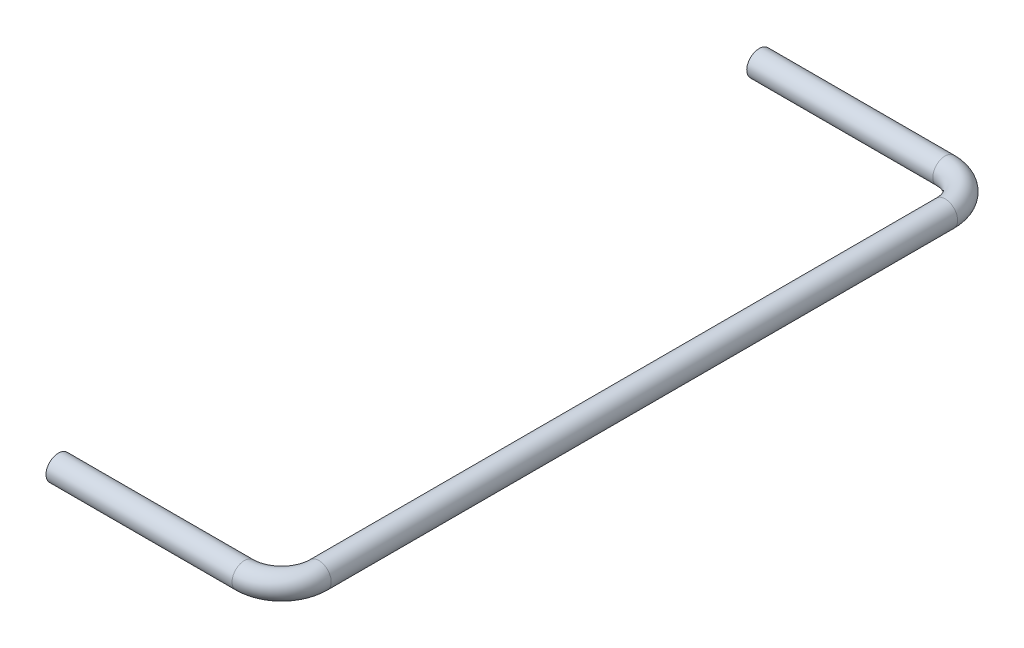
ISO-10303-21;
HEADER;
FILE_DESCRIPTION(('STEP AP214'),'2;1');
FILE_NAME('part.step','',(''),(''),'','','');
FILE_SCHEMA(('AUTOMOTIVE_DESIGN { 1 0 10303 214 1 1 1 1 }'));
ENDSEC;
DATA;
#1=APPLICATION_CONTEXT('core data for automotive mechanical design processes');
#2=APPLICATION_PROTOCOL_DEFINITION('international standard','automotive_design',2000,#1);
#3=PRODUCT_CONTEXT('',#1,'mechanical');
#4=PRODUCT('Part','Part','',(#3));
#5=PRODUCT_RELATED_PRODUCT_CATEGORY('part','',(#4));
#6=PRODUCT_DEFINITION_FORMATION('','',#4);
#7=PRODUCT_DEFINITION_CONTEXT('part definition',#1,'design');
#8=PRODUCT_DEFINITION('design','',#6,#7);
#9=PRODUCT_DEFINITION_SHAPE('','',#8);
#10=(LENGTH_UNIT() NAMED_UNIT(*) SI_UNIT(.MILLI.,.METRE.));
#11=(NAMED_UNIT(*) PLANE_ANGLE_UNIT() SI_UNIT($,.RADIAN.));
#12=(NAMED_UNIT(*) SI_UNIT($,.STERADIAN.) SOLID_ANGLE_UNIT());
#13=UNCERTAINTY_MEASURE_WITH_UNIT(LENGTH_MEASURE(1.E-05),#10,'distance_accuracy_value','');
#14=(GEOMETRIC_REPRESENTATION_CONTEXT(3) GLOBAL_UNCERTAINTY_ASSIGNED_CONTEXT((#13)) GLOBAL_UNIT_ASSIGNED_CONTEXT((#10,
#11,#12)) REPRESENTATION_CONTEXT('',''));
#15=CARTESIAN_POINT('',(0.,0.,0.));
#16=DIRECTION('',(0.,0.,1.));
#17=DIRECTION('',(1.,0.,0.));
#18=AXIS2_PLACEMENT_3D('',#15,#16,#17);
#19=CARTESIAN_POINT('',(15.,0.,-56.5));
#20=DIRECTION('',(-1.,0.,0.));
#21=DIRECTION('',(0.,0.,1.));
#22=AXIS2_PLACEMENT_3D('',#19,#20,#21);
#23=CYLINDRICAL_SURFACE('',#22,1.);
#24=CARTESIAN_POINT('',(15.,0.,-56.5));
#25=DIRECTION('',(-1.,0.,0.));
#26=DIRECTION('',(0.,0.,1.));
#27=AXIS2_PLACEMENT_3D('',#24,#25,#26);
#28=CIRCLE('',#27,1.);
#29=CARTESIAN_POINT('',(15.,0.,-57.5));
#30=VERTEX_POINT('',#29);
#31=EDGE_CURVE('E36',#30,#30,#28,.T.);
#32=ORIENTED_EDGE('',*,*,#31,.T.);
#33=EDGE_LOOP('',(#32));
#34=FACE_BOUND('',#33,.T.);
#35=CARTESIAN_POINT('',(0.,0.,-56.5));
#36=DIRECTION('',(-1.,0.,0.));
#37=DIRECTION('',(0.,0.,1.));
#38=AXIS2_PLACEMENT_3D('',#35,#36,#37);
#39=CIRCLE('',#38,1.);
#40=CARTESIAN_POINT('',(0.,0.,-55.5));
#41=VERTEX_POINT('',#40);
#42=EDGE_CURVE('E10',#41,#41,#39,.T.);
#43=ORIENTED_EDGE('',*,*,#42,.F.);
#44=EDGE_LOOP('',(#43));
#45=FACE_BOUND('',#44,.T.);
#46=ADVANCED_FACE('F30',(#34,#45),#23,.T.);
#47=CARTESIAN_POINT('',(15.,0.,-53.5));
#48=DIRECTION('',(0.,1.,0.));
#49=DIRECTION('',(0.,0.,1.));
#50=AXIS2_PLACEMENT_3D('',#47,#48,#49);
#51=TOROIDAL_SURFACE('',#50,3.,1.);
#52=CARTESIAN_POINT('',(18.,0.,-53.5));
#53=DIRECTION('',(0.,0.,-1.));
#54=DIRECTION('',(-1.,0.,0.));
#55=AXIS2_PLACEMENT_3D('',#52,#53,#54);
#56=CIRCLE('',#55,1.);
#57=CARTESIAN_POINT('',(19.,0.,-53.5));
#58=VERTEX_POINT('',#57);
#59=EDGE_CURVE('E40',#58,#58,#56,.T.);
#60=CARTESIAN_POINT('',(15.,0.,-53.5));
#61=DIRECTION('',(0.,1.,0.));
#62=DIRECTION('',(0.,0.,1.));
#63=AXIS2_PLACEMENT_3D('',#60,#61,#62);
#64=CIRCLE('',#63,4.);
#65=EDGE_CURVE('',#58,#30,#64,.T.);
#66=ORIENTED_EDGE('',*,*,#59,.T.);
#67=ORIENTED_EDGE('',*,*,#31,.F.);
#68=ORIENTED_EDGE('',*,*,#65,.T.);
#69=ORIENTED_EDGE('',*,*,#65,.F.);
#70=EDGE_LOOP('',(#66,#68,#67,#69));
#71=FACE_BOUND('',#70,.T.);
#72=ADVANCED_FACE('F74',(#71),#51,.T.);
#73=CARTESIAN_POINT('',(18.,0.,-3.));
#74=DIRECTION('',(0.,0.,-1.));
#75=DIRECTION('',(-1.,0.,0.));
#76=AXIS2_PLACEMENT_3D('',#73,#74,#75);
#77=CYLINDRICAL_SURFACE('',#76,1.);
#78=CARTESIAN_POINT('',(18.,0.,-3.));
#79=DIRECTION('',(0.,0.,-1.));
#80=DIRECTION('',(-1.,0.,0.));
#81=AXIS2_PLACEMENT_3D('',#78,#79,#80);
#82=CIRCLE('',#81,1.);
#83=CARTESIAN_POINT('',(19.,0.,-3.));
#84=VERTEX_POINT('',#83);
#85=EDGE_CURVE('E44',#84,#84,#82,.T.);
#86=ORIENTED_EDGE('',*,*,#85,.T.);
#87=EDGE_LOOP('',(#86));
#88=FACE_BOUND('',#87,.T.);
#89=ORIENTED_EDGE('',*,*,#59,.F.);
#90=EDGE_LOOP('',(#89));
#91=FACE_BOUND('',#90,.T.);
#92=ADVANCED_FACE('F78',(#88,#91),#77,.T.);
#93=CARTESIAN_POINT('',(15.,0.,-3.));
#94=DIRECTION('',(0.,1.,0.));
#95=DIRECTION('',(0.,0.,1.));
#96=AXIS2_PLACEMENT_3D('',#93,#94,#95);
#97=TOROIDAL_SURFACE('',#96,3.,1.);
#98=CARTESIAN_POINT('',(15.,0.,0.));
#99=DIRECTION('',(1.,0.,0.));
#100=DIRECTION('',(0.,0.,-1.));
#101=AXIS2_PLACEMENT_3D('',#98,#99,#100);
#102=CIRCLE('',#101,1.);
#103=CARTESIAN_POINT('',(15.,0.,1.));
#104=VERTEX_POINT('',#103);
#105=EDGE_CURVE('E49',#104,#104,#102,.T.);
#106=CARTESIAN_POINT('',(15.,0.,-3.));
#107=DIRECTION('',(0.,1.,0.));
#108=DIRECTION('',(0.,0.,1.));
#109=AXIS2_PLACEMENT_3D('',#106,#107,#108);
#110=CIRCLE('',#109,4.);
#111=EDGE_CURVE('',#104,#84,#110,.T.);
#112=ORIENTED_EDGE('',*,*,#105,.T.);
#113=ORIENTED_EDGE('',*,*,#85,.F.);
#114=ORIENTED_EDGE('',*,*,#111,.T.);
#115=ORIENTED_EDGE('',*,*,#111,.F.);
#116=EDGE_LOOP('',(#112,#114,#113,#115));
#117=FACE_BOUND('',#116,.T.);
#118=ADVANCED_FACE('F56',(#117),#97,.T.);
#119=CARTESIAN_POINT('',(15.,0.,0.));
#120=DIRECTION('',(-1.,0.,0.));
#121=DIRECTION('',(0.,0.,1.));
#122=AXIS2_PLACEMENT_3D('',#119,#120,#121);
#123=CYLINDRICAL_SURFACE('',#122,1.);
#124=ORIENTED_EDGE('',*,*,#105,.F.);
#125=EDGE_LOOP('',(#124));
#126=FACE_BOUND('',#125,.T.);
#127=CARTESIAN_POINT('',(0.,0.,0.));
#128=DIRECTION('',(1.,0.,0.));
#129=DIRECTION('',(0.,0.,-1.));
#130=AXIS2_PLACEMENT_3D('',#127,#128,#129);
#131=CIRCLE('',#130,1.);
#132=CARTESIAN_POINT('',(0.,0.,-1.));
#133=VERTEX_POINT('',#132);
#134=EDGE_CURVE('E50',#133,#133,#131,.T.);
#135=ORIENTED_EDGE('',*,*,#134,.T.);
#136=EDGE_LOOP('',(#135));
#137=FACE_BOUND('',#136,.T.);
#138=ADVANCED_FACE('F59',(#126,#137),#123,.T.);
#139=CARTESIAN_POINT('',(0.,0.,-56.5));
#140=DIRECTION('',(-1.,0.,0.));
#141=DIRECTION('',(0.,0.,1.));
#142=AXIS2_PLACEMENT_3D('',#139,#140,#141);
#143=PLANE('',#142);
#144=ORIENTED_EDGE('',*,*,#42,.T.);
#145=EDGE_LOOP('',(#144));
#146=FACE_BOUND('',#145,.T.);
#147=ADVANCED_FACE('F62',(#146),#143,.T.);
#148=CARTESIAN_POINT('',(0.,0.,0.));
#149=DIRECTION('',(1.,0.,0.));
#150=DIRECTION('',(0.,0.,-1.));
#151=AXIS2_PLACEMENT_3D('',#148,#149,#150);
#152=PLANE('',#151);
#153=ORIENTED_EDGE('',*,*,#134,.F.);
#154=EDGE_LOOP('',(#153));
#155=FACE_BOUND('',#154,.T.);
#156=ADVANCED_FACE('F66',(#155),#152,.F.);
#157=CLOSED_SHELL('',(#46,#72,#92,#118,#138,#147,#156));
#158=MANIFOLD_SOLID_BREP('B2',#157);
#159=ADVANCED_BREP_SHAPE_REPRESENTATION('',(#18,#158),#14);
#160=SHAPE_DEFINITION_REPRESENTATION(#9,#159);
ENDSEC;
END-ISO-10303-21;
